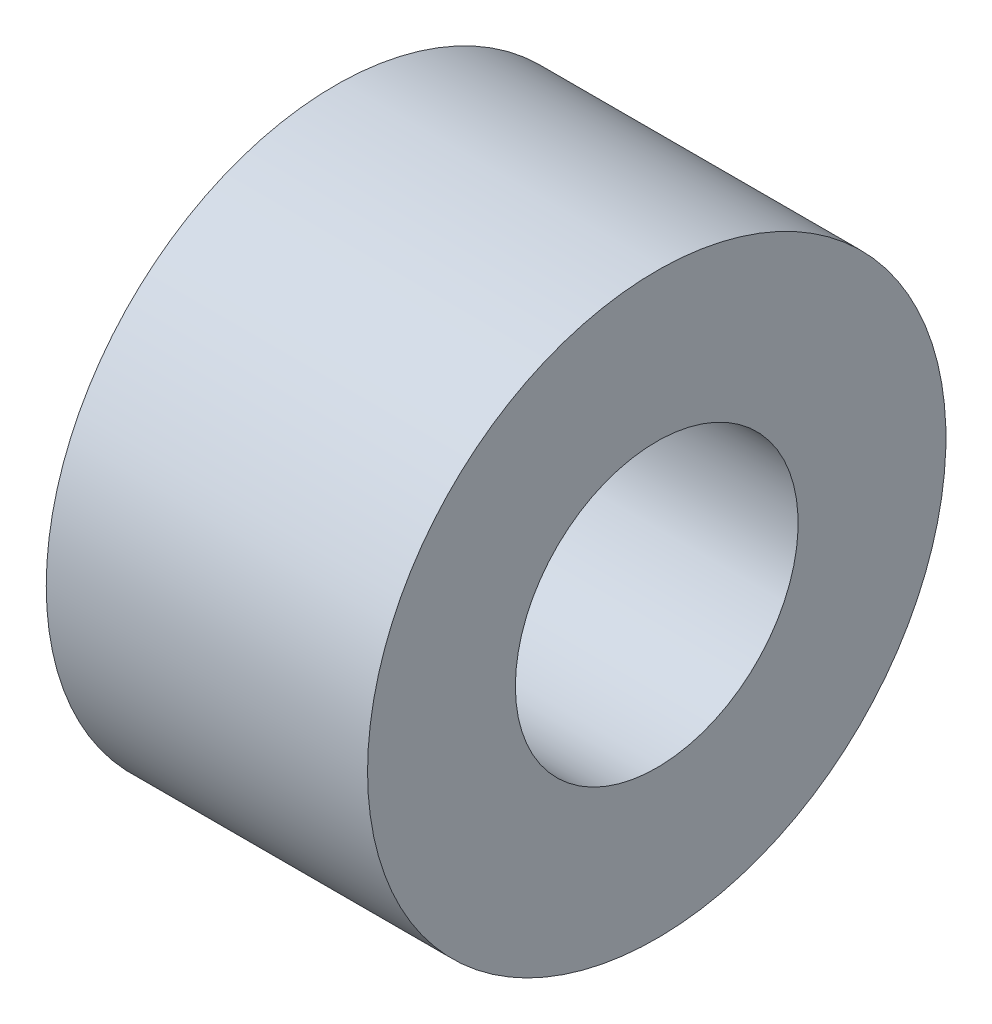
ISO-10303-21;
HEADER;
FILE_DESCRIPTION(('STEP AP214'),'2;1');
FILE_NAME('part.step','',(''),(''),'','','');
FILE_SCHEMA(('AUTOMOTIVE_DESIGN { 1 0 10303 214 1 1 1 1 }'));
ENDSEC;
DATA;
#1=APPLICATION_CONTEXT('core data for automotive mechanical design processes');
#2=APPLICATION_PROTOCOL_DEFINITION('international standard','automotive_design',2000,#1);
#3=PRODUCT_CONTEXT('',#1,'mechanical');
#4=PRODUCT('Part','Part','',(#3));
#5=PRODUCT_RELATED_PRODUCT_CATEGORY('part','',(#4));
#6=PRODUCT_DEFINITION_FORMATION('','',#4);
#7=PRODUCT_DEFINITION_CONTEXT('part definition',#1,'design');
#8=PRODUCT_DEFINITION('design','',#6,#7);
#9=PRODUCT_DEFINITION_SHAPE('','',#8);
#10=(LENGTH_UNIT() NAMED_UNIT(*) SI_UNIT(.MILLI.,.METRE.));
#11=(NAMED_UNIT(*) PLANE_ANGLE_UNIT() SI_UNIT($,.RADIAN.));
#12=(NAMED_UNIT(*) SI_UNIT($,.STERADIAN.) SOLID_ANGLE_UNIT());
#13=UNCERTAINTY_MEASURE_WITH_UNIT(LENGTH_MEASURE(1.E-05),#10,'distance_accuracy_value','');
#14=(GEOMETRIC_REPRESENTATION_CONTEXT(3) GLOBAL_UNCERTAINTY_ASSIGNED_CONTEXT((#13)) GLOBAL_UNIT_ASSIGNED_CONTEXT((#10,
#11,#12)) REPRESENTATION_CONTEXT('',''));
#15=CARTESIAN_POINT('',(0.,0.,0.));
#16=DIRECTION('',(0.,0.,1.));
#17=DIRECTION('',(1.,0.,0.));
#18=AXIS2_PLACEMENT_3D('',#15,#16,#17);
#19=CARTESIAN_POINT('',(0.,2.25,0.));
#20=DIRECTION('',(1.,0.,0.));
#21=DIRECTION('',(0.,0.,-1.));
#22=AXIS2_PLACEMENT_3D('',#19,#20,#21);
#23=PLANE('',#22);
#24=CARTESIAN_POINT('',(0.,0.,0.));
#25=DIRECTION('',(-1.,0.,0.));
#26=DIRECTION('',(0.,0.,1.));
#27=AXIS2_PLACEMENT_3D('',#24,#25,#26);
#28=CIRCLE('',#27,1.1);
#29=CARTESIAN_POINT('',(0.,0.,1.1));
#30=VERTEX_POINT('',#29);
#31=EDGE_CURVE('E10',#30,#30,#28,.T.);
#32=ORIENTED_EDGE('',*,*,#31,.F.);
#33=EDGE_LOOP('',(#32));
#34=FACE_BOUND('',#33,.T.);
#35=CARTESIAN_POINT('',(0.,0.,0.));
#36=DIRECTION('',(-1.,0.,0.));
#37=DIRECTION('',(0.,0.,1.));
#38=AXIS2_PLACEMENT_3D('',#35,#36,#37);
#39=CIRCLE('',#38,2.25);
#40=CARTESIAN_POINT('',(0.,0.,2.25));
#41=VERTEX_POINT('',#40);
#42=EDGE_CURVE('E54',#41,#41,#39,.T.);
#43=ORIENTED_EDGE('',*,*,#42,.T.);
#44=EDGE_LOOP('',(#43));
#45=FACE_BOUND('',#44,.T.);
#46=ADVANCED_FACE('F37',(#34,#45),#23,.F.);
#47=CARTESIAN_POINT('',(0.,0.,0.));
#48=DIRECTION('',(-1.,0.,0.));
#49=DIRECTION('',(0.,0.,1.));
#50=AXIS2_PLACEMENT_3D('',#47,#48,#49);
#51=CYLINDRICAL_SURFACE('',#50,1.1);
#52=CARTESIAN_POINT('',(2.5,0.,0.));
#53=DIRECTION('',(-1.,0.,0.));
#54=DIRECTION('',(0.,0.,1.));
#55=AXIS2_PLACEMENT_3D('',#52,#53,#54);
#56=CIRCLE('',#55,1.1);
#57=CARTESIAN_POINT('',(2.5,0.,1.1));
#58=VERTEX_POINT('',#57);
#59=EDGE_CURVE('E44',#58,#58,#56,.T.);
#60=ORIENTED_EDGE('',*,*,#59,.F.);
#61=EDGE_LOOP('',(#60));
#62=FACE_BOUND('',#61,.T.);
#63=ORIENTED_EDGE('',*,*,#31,.T.);
#64=EDGE_LOOP('',(#63));
#65=FACE_BOUND('',#64,.T.);
#66=ADVANCED_FACE('F70',(#62,#65),#51,.F.);
#67=CARTESIAN_POINT('',(2.5,1.1,0.));
#68=DIRECTION('',(-1.,0.,0.));
#69=DIRECTION('',(0.,0.,1.));
#70=AXIS2_PLACEMENT_3D('',#67,#68,#69);
#71=PLANE('',#70);
#72=CARTESIAN_POINT('',(2.5,0.,0.));
#73=DIRECTION('',(-1.,0.,0.));
#74=DIRECTION('',(0.,0.,1.));
#75=AXIS2_PLACEMENT_3D('',#72,#73,#74);
#76=CIRCLE('',#75,2.25);
#77=CARTESIAN_POINT('',(2.5,0.,2.25));
#78=VERTEX_POINT('',#77);
#79=EDGE_CURVE('E49',#78,#78,#76,.T.);
#80=ORIENTED_EDGE('',*,*,#79,.F.);
#81=EDGE_LOOP('',(#80));
#82=FACE_BOUND('',#81,.T.);
#83=ORIENTED_EDGE('',*,*,#59,.T.);
#84=EDGE_LOOP('',(#83));
#85=FACE_BOUND('',#84,.T.);
#86=ADVANCED_FACE('F65',(#82,#85),#71,.F.);
#87=CARTESIAN_POINT('',(0.,0.,0.));
#88=DIRECTION('',(-1.,0.,0.));
#89=DIRECTION('',(0.,0.,1.));
#90=AXIS2_PLACEMENT_3D('',#87,#88,#89);
#91=CYLINDRICAL_SURFACE('',#90,2.25);
#92=ORIENTED_EDGE('',*,*,#42,.F.);
#93=EDGE_LOOP('',(#92));
#94=FACE_BOUND('',#93,.T.);
#95=ORIENTED_EDGE('',*,*,#79,.T.);
#96=EDGE_LOOP('',(#95));
#97=FACE_BOUND('',#96,.T.);
#98=ADVANCED_FACE('F62',(#94,#97),#91,.T.);
#99=CLOSED_SHELL('',(#46,#66,#86,#98));
#100=MANIFOLD_SOLID_BREP('B2',#99);
#101=ADVANCED_BREP_SHAPE_REPRESENTATION('',(#18,#100),#14);
#102=SHAPE_DEFINITION_REPRESENTATION(#9,#101);
ENDSEC;
END-ISO-10303-21;
